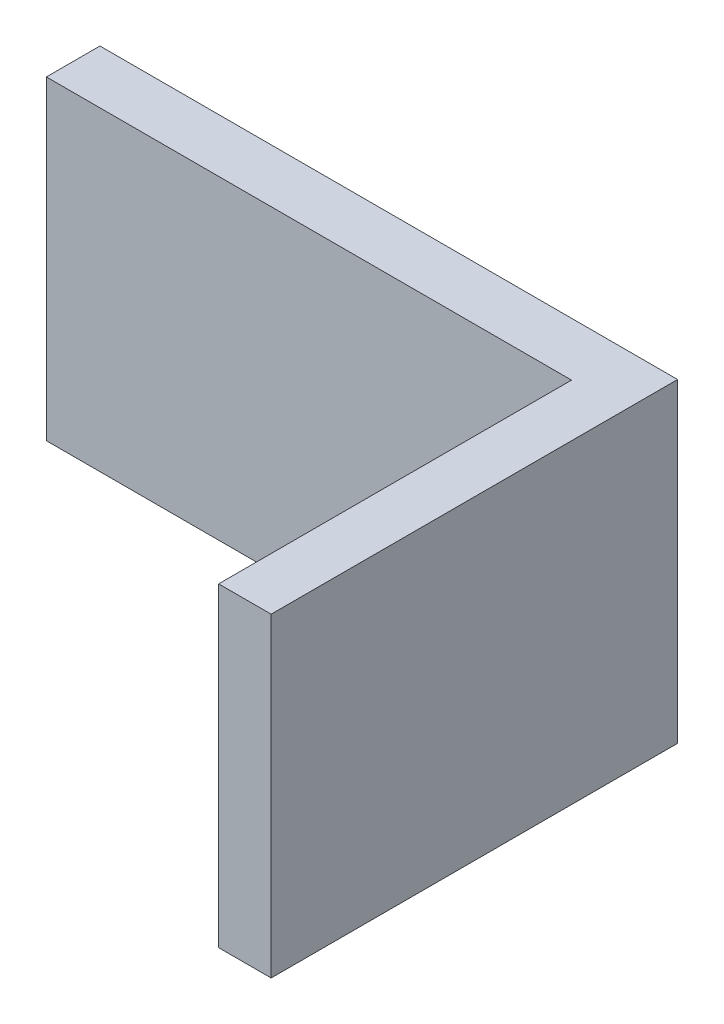
ISO-10303-21;
HEADER;
FILE_DESCRIPTION(('STEP AP214'),'2;1');
FILE_NAME('part.step','',(''),(''),'','','');
FILE_SCHEMA(('AUTOMOTIVE_DESIGN { 1 0 10303 214 1 1 1 1 }'));
ENDSEC;
DATA;
#1=APPLICATION_CONTEXT('core data for automotive mechanical design processes');
#2=APPLICATION_PROTOCOL_DEFINITION('international standard','automotive_design',2000,#1);
#3=PRODUCT_CONTEXT('',#1,'mechanical');
#4=PRODUCT('Part','Part','',(#3));
#5=PRODUCT_RELATED_PRODUCT_CATEGORY('part','',(#4));
#6=PRODUCT_DEFINITION_FORMATION('','',#4);
#7=PRODUCT_DEFINITION_CONTEXT('part definition',#1,'design');
#8=PRODUCT_DEFINITION('design','',#6,#7);
#9=PRODUCT_DEFINITION_SHAPE('','',#8);
#10=(LENGTH_UNIT() NAMED_UNIT(*) SI_UNIT(.MILLI.,.METRE.));
#11=(NAMED_UNIT(*) PLANE_ANGLE_UNIT() SI_UNIT($,.RADIAN.));
#12=(NAMED_UNIT(*) SI_UNIT($,.STERADIAN.) SOLID_ANGLE_UNIT());
#13=UNCERTAINTY_MEASURE_WITH_UNIT(LENGTH_MEASURE(1.E-05),#10,'distance_accuracy_value','');
#14=(GEOMETRIC_REPRESENTATION_CONTEXT(3) GLOBAL_UNCERTAINTY_ASSIGNED_CONTEXT((#13)) GLOBAL_UNIT_ASSIGNED_CONTEXT((#10,
#11,#12)) REPRESENTATION_CONTEXT('',''));
#15=CARTESIAN_POINT('',(0.,0.,0.));
#16=DIRECTION('',(0.,0.,1.));
#17=DIRECTION('',(1.,0.,0.));
#18=AXIS2_PLACEMENT_3D('',#15,#16,#17);
#19=CARTESIAN_POINT('',(4.55,-2.6,0.));
#20=DIRECTION('',(0.,1.,0.));
#21=DIRECTION('',(0.,0.,1.));
#22=AXIS2_PLACEMENT_3D('',#19,#20,#21);
#23=PLANE('',#22);
#24=DIRECTION('',(1.,0.,0.));
#25=VECTOR('',#24,1.);
#26=CARTESIAN_POINT('',(4.,-2.6,0.));
#27=LINE('',#26,#25);
#28=CARTESIAN_POINT('',(4.,-2.6,0.));
#29=VERTEX_POINT('',#28);
#30=CARTESIAN_POINT('',(4.55,-2.6,0.));
#31=VERTEX_POINT('',#30);
#32=EDGE_CURVE('E11',#29,#31,#27,.T.);
#33=ORIENTED_EDGE('',*,*,#32,.F.);
#34=DIRECTION('',(0.,0.,-1.));
#35=VECTOR('',#34,1.);
#36=CARTESIAN_POINT('',(4.,-2.6,0.051));
#37=LINE('',#36,#35);
#38=CARTESIAN_POINT('',(4.,-2.6,0.051));
#39=VERTEX_POINT('',#38);
#40=EDGE_CURVE('E24',#39,#29,#37,.T.);
#41=ORIENTED_EDGE('',*,*,#40,.F.);
#42=DIRECTION('',(-1.,0.,0.));
#43=VECTOR('',#42,1.);
#44=CARTESIAN_POINT('',(4.5,-2.6,0.051));
#45=LINE('',#44,#43);
#46=CARTESIAN_POINT('',(4.5,-2.6,0.051));
#47=VERTEX_POINT('',#46);
#48=EDGE_CURVE('E87',#47,#39,#45,.T.);
#49=ORIENTED_EDGE('',*,*,#48,.F.);
#50=DIRECTION('',(0.,0.,-1.));
#51=VECTOR('',#50,1.);
#52=CARTESIAN_POINT('',(4.5,-2.6,0.387));
#53=LINE('',#52,#51);
#54=CARTESIAN_POINT('',(4.5,-2.6,0.387));
#55=VERTEX_POINT('',#54);
#56=EDGE_CURVE('E114',#55,#47,#53,.T.);
#57=ORIENTED_EDGE('',*,*,#56,.F.);
#58=DIRECTION('',(-1.,0.,0.));
#59=VECTOR('',#58,1.);
#60=CARTESIAN_POINT('',(4.55,-2.6,0.387));
#61=LINE('',#60,#59);
#62=CARTESIAN_POINT('',(4.55,-2.6,0.387));
#63=VERTEX_POINT('',#62);
#64=EDGE_CURVE('E111',#63,#55,#61,.T.);
#65=ORIENTED_EDGE('',*,*,#64,.F.);
#66=DIRECTION('',(0.,0.,1.));
#67=VECTOR('',#66,1.);
#68=CARTESIAN_POINT('',(4.55,-2.6,0.));
#69=LINE('',#68,#67);
#70=EDGE_CURVE('E108',#31,#63,#69,.T.);
#71=ORIENTED_EDGE('',*,*,#70,.F.);
#72=EDGE_LOOP('',(#33,#41,#49,#57,#65,#71));
#73=FACE_BOUND('',#72,.T.);
#74=ADVANCED_FACE('F17',(#73),#23,.T.);
#75=CARTESIAN_POINT('',(4.,-2.9,0.));
#76=DIRECTION('',(0.,-1.,0.));
#77=DIRECTION('',(0.,0.,1.));
#78=AXIS2_PLACEMENT_3D('',#75,#76,#77);
#79=PLANE('',#78);
#80=DIRECTION('',(-1.,0.,0.));
#81=VECTOR('',#80,1.);
#82=CARTESIAN_POINT('',(4.55,-2.9,0.));
#83=LINE('',#82,#81);
#84=CARTESIAN_POINT('',(4.55,-2.9,0.));
#85=VERTEX_POINT('',#84);
#86=CARTESIAN_POINT('',(4.,-2.9,0.));
#87=VERTEX_POINT('',#86);
#88=EDGE_CURVE('E106',#85,#87,#83,.T.);
#89=ORIENTED_EDGE('',*,*,#88,.F.);
#90=DIRECTION('',(0.,0.,-1.));
#91=VECTOR('',#90,1.);
#92=CARTESIAN_POINT('',(4.55,-2.9,0.387));
#93=LINE('',#92,#91);
#94=CARTESIAN_POINT('',(4.55,-2.9,0.387));
#95=VERTEX_POINT('',#94);
#96=EDGE_CURVE('E103',#95,#85,#93,.T.);
#97=ORIENTED_EDGE('',*,*,#96,.F.);
#98=DIRECTION('',(1.,0.,0.));
#99=VECTOR('',#98,1.);
#100=CARTESIAN_POINT('',(4.5,-2.9,0.387));
#101=LINE('',#100,#99);
#102=CARTESIAN_POINT('',(4.5,-2.9,0.387));
#103=VERTEX_POINT('',#102);
#104=EDGE_CURVE('E100',#103,#95,#101,.T.);
#105=ORIENTED_EDGE('',*,*,#104,.F.);
#106=DIRECTION('',(0.,0.,1.));
#107=VECTOR('',#106,1.);
#108=CARTESIAN_POINT('',(4.5,-2.9,0.051));
#109=LINE('',#108,#107);
#110=CARTESIAN_POINT('',(4.5,-2.9,0.051));
#111=VERTEX_POINT('',#110);
#112=EDGE_CURVE('E72',#111,#103,#109,.T.);
#113=ORIENTED_EDGE('',*,*,#112,.F.);
#114=DIRECTION('',(1.,0.,0.));
#115=VECTOR('',#114,1.);
#116=CARTESIAN_POINT('',(4.,-2.9,0.051));
#117=LINE('',#116,#115);
#118=CARTESIAN_POINT('',(4.,-2.9,0.051));
#119=VERTEX_POINT('',#118);
#120=EDGE_CURVE('E66',#119,#111,#117,.T.);
#121=ORIENTED_EDGE('',*,*,#120,.F.);
#122=DIRECTION('',(0.,0.,1.));
#123=VECTOR('',#122,1.);
#124=CARTESIAN_POINT('',(4.,-2.9,0.));
#125=LINE('',#124,#123);
#126=EDGE_CURVE('E69',#87,#119,#125,.T.);
#127=ORIENTED_EDGE('',*,*,#126,.F.);
#128=EDGE_LOOP('',(#89,#97,#105,#113,#121,#127));
#129=FACE_BOUND('',#128,.T.);
#130=ADVANCED_FACE('F68',(#129),#79,.T.);
#131=CARTESIAN_POINT('',(4.55,-2.6,0.387));
#132=DIRECTION('',(0.,0.,1.));
#133=DIRECTION('',(0.,1.,0.));
#134=AXIS2_PLACEMENT_3D('',#131,#132,#133);
#135=PLANE('',#134);
#136=ORIENTED_EDGE('',*,*,#64,.T.);
#137=DIRECTION('',(0.,1.,0.));
#138=VECTOR('',#137,1.);
#139=CARTESIAN_POINT('',(4.5,-2.9,0.387));
#140=LINE('',#139,#138);
#141=EDGE_CURVE('E83',#103,#55,#140,.T.);
#142=ORIENTED_EDGE('',*,*,#141,.F.);
#143=ORIENTED_EDGE('',*,*,#104,.T.);
#144=DIRECTION('',(0.,-1.,0.));
#145=VECTOR('',#144,1.);
#146=CARTESIAN_POINT('',(4.55,-2.6,0.387));
#147=LINE('',#146,#145);
#148=EDGE_CURVE('E88',#63,#95,#147,.T.);
#149=ORIENTED_EDGE('',*,*,#148,.F.);
#150=EDGE_LOOP('',(#136,#142,#143,#149));
#151=FACE_BOUND('',#150,.T.);
#152=ADVANCED_FACE('F125',(#151),#135,.T.);
#153=CARTESIAN_POINT('',(4.5,-2.6,0.051));
#154=DIRECTION('',(0.,0.,1.));
#155=DIRECTION('',(0.,1.,0.));
#156=AXIS2_PLACEMENT_3D('',#153,#154,#155);
#157=PLANE('',#156);
#158=ORIENTED_EDGE('',*,*,#48,.T.);
#159=DIRECTION('',(0.,1.,0.));
#160=VECTOR('',#159,1.);
#161=CARTESIAN_POINT('',(4.,-2.9,0.051));
#162=LINE('',#161,#160);
#163=EDGE_CURVE('E81',#119,#39,#162,.T.);
#164=ORIENTED_EDGE('',*,*,#163,.F.);
#165=ORIENTED_EDGE('',*,*,#120,.T.);
#166=DIRECTION('',(0.,-1.,0.));
#167=VECTOR('',#166,1.);
#168=CARTESIAN_POINT('',(4.5,-2.6,0.051));
#169=LINE('',#168,#167);
#170=EDGE_CURVE('E89',#47,#111,#169,.T.);
#171=ORIENTED_EDGE('',*,*,#170,.F.);
#172=EDGE_LOOP('',(#158,#164,#165,#171));
#173=FACE_BOUND('',#172,.T.);
#174=ADVANCED_FACE('F86',(#173),#157,.T.);
#175=CARTESIAN_POINT('',(4.55,-2.9,0.));
#176=DIRECTION('',(1.,0.,0.));
#177=DIRECTION('',(0.,0.,1.));
#178=AXIS2_PLACEMENT_3D('',#175,#176,#177);
#179=PLANE('',#178);
#180=DIRECTION('',(0.,-1.,0.));
#181=VECTOR('',#180,1.);
#182=CARTESIAN_POINT('',(4.55,-2.6,0.));
#183=LINE('',#182,#181);
#184=EDGE_CURVE('E93',#31,#85,#183,.T.);
#185=ORIENTED_EDGE('',*,*,#184,.F.);
#186=ORIENTED_EDGE('',*,*,#70,.T.);
#187=ORIENTED_EDGE('',*,*,#148,.T.);
#188=ORIENTED_EDGE('',*,*,#96,.T.);
#189=EDGE_LOOP('',(#185,#186,#187,#188));
#190=FACE_BOUND('',#189,.T.);
#191=ADVANCED_FACE('F121',(#190),#179,.T.);
#192=CARTESIAN_POINT('',(4.,-2.6,0.));
#193=DIRECTION('',(-1.,0.,0.));
#194=DIRECTION('',(0.,0.,1.));
#195=AXIS2_PLACEMENT_3D('',#192,#193,#194);
#196=PLANE('',#195);
#197=DIRECTION('',(0.,1.,0.));
#198=VECTOR('',#197,1.);
#199=CARTESIAN_POINT('',(4.,-2.9,0.));
#200=LINE('',#199,#198);
#201=EDGE_CURVE('E82',#87,#29,#200,.T.);
#202=ORIENTED_EDGE('',*,*,#201,.F.);
#203=ORIENTED_EDGE('',*,*,#126,.T.);
#204=ORIENTED_EDGE('',*,*,#163,.T.);
#205=ORIENTED_EDGE('',*,*,#40,.T.);
#206=EDGE_LOOP('',(#202,#203,#204,#205));
#207=FACE_BOUND('',#206,.T.);
#208=ADVANCED_FACE('F80',(#207),#196,.T.);
#209=CARTESIAN_POINT('',(4.5,-2.6,0.051));
#210=DIRECTION('',(-1.,0.,0.));
#211=DIRECTION('',(0.,0.,1.));
#212=AXIS2_PLACEMENT_3D('',#209,#210,#211);
#213=PLANE('',#212);
#214=ORIENTED_EDGE('',*,*,#170,.T.);
#215=ORIENTED_EDGE('',*,*,#112,.T.);
#216=ORIENTED_EDGE('',*,*,#141,.T.);
#217=ORIENTED_EDGE('',*,*,#56,.T.);
#218=EDGE_LOOP('',(#214,#215,#216,#217));
#219=FACE_BOUND('',#218,.T.);
#220=ADVANCED_FACE('F127',(#219),#213,.T.);
#221=CARTESIAN_POINT('',(4.55,-2.9,0.));
#222=DIRECTION('',(0.,0.,-1.));
#223=DIRECTION('',(0.,1.,0.));
#224=AXIS2_PLACEMENT_3D('',#221,#222,#223);
#225=PLANE('',#224);
#226=ORIENTED_EDGE('',*,*,#88,.T.);
#227=ORIENTED_EDGE('',*,*,#201,.T.);
#228=ORIENTED_EDGE('',*,*,#32,.T.);
#229=ORIENTED_EDGE('',*,*,#184,.T.);
#230=EDGE_LOOP('',(#226,#227,#228,#229));
#231=FACE_BOUND('',#230,.T.);
#232=ADVANCED_FACE('F117',(#231),#225,.T.);
#233=CLOSED_SHELL('',(#74,#130,#152,#174,#191,#208,#220,#232));
#234=MANIFOLD_SOLID_BREP('B1',#233);
#235=ADVANCED_BREP_SHAPE_REPRESENTATION('',(#18,#234),#14);
#236=SHAPE_DEFINITION_REPRESENTATION(#9,#235);
ENDSEC;
END-ISO-10303-21;
